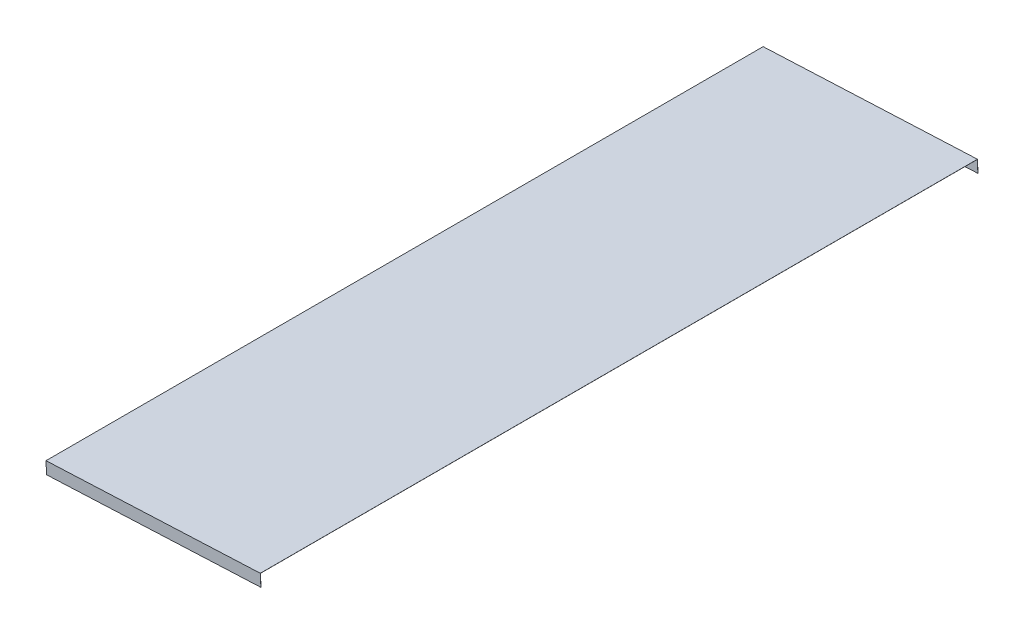
ISO-10303-21;
HEADER;
FILE_DESCRIPTION(('STEP AP214'),'2;1');
FILE_NAME('part.step','',(''),(''),'','','');
FILE_SCHEMA(('AUTOMOTIVE_DESIGN { 1 0 10303 214 1 1 1 1 }'));
ENDSEC;
DATA;
#1=APPLICATION_CONTEXT('core data for automotive mechanical design processes');
#2=APPLICATION_PROTOCOL_DEFINITION('international standard','automotive_design',2000,#1);
#3=PRODUCT_CONTEXT('',#1,'mechanical');
#4=PRODUCT('Part','Part','',(#3));
#5=PRODUCT_RELATED_PRODUCT_CATEGORY('part','',(#4));
#6=PRODUCT_DEFINITION_FORMATION('','',#4);
#7=PRODUCT_DEFINITION_CONTEXT('part definition',#1,'design');
#8=PRODUCT_DEFINITION('design','',#6,#7);
#9=PRODUCT_DEFINITION_SHAPE('','',#8);
#10=(LENGTH_UNIT() NAMED_UNIT(*) SI_UNIT(.MILLI.,.METRE.));
#11=(NAMED_UNIT(*) PLANE_ANGLE_UNIT() SI_UNIT($,.RADIAN.));
#12=(NAMED_UNIT(*) SI_UNIT($,.STERADIAN.) SOLID_ANGLE_UNIT());
#13=UNCERTAINTY_MEASURE_WITH_UNIT(LENGTH_MEASURE(1.E-05),#10,'distance_accuracy_value','');
#14=(GEOMETRIC_REPRESENTATION_CONTEXT(3) GLOBAL_UNCERTAINTY_ASSIGNED_CONTEXT((#13)) GLOBAL_UNIT_ASSIGNED_CONTEXT((#10,
#11,#12)) REPRESENTATION_CONTEXT('',''));
#15=CARTESIAN_POINT('',(0.,0.,0.));
#16=DIRECTION('',(0.,0.,1.));
#17=DIRECTION('',(1.,0.,0.));
#18=AXIS2_PLACEMENT_3D('',#15,#16,#17);
#19=CARTESIAN_POINT('',(-1723.97557604015,565.354199265099,600.));
#20=DIRECTION('',(0.998984631984017,0.0450522481099321,0.));
#21=DIRECTION('',(-0.0450522481099321,0.998984631984017,0.));
#22=AXIS2_PLACEMENT_3D('',#19,#20,#21);
#23=PLANE('',#22);
#24=DIRECTION('',(0.,0.,-1.));
#25=VECTOR('',#24,1.);
#26=CARTESIAN_POINT('',(-1723.97107081534,565.254300801901,600.));
#27=LINE('',#26,#25);
#28=CARTESIAN_POINT('',(-1723.97107081534,565.254300801901,599.9));
#29=VERTEX_POINT('',#28);
#30=CARTESIAN_POINT('',(-1723.97107081534,565.254300801901,0.099999999999989));
#31=VERTEX_POINT('',#30);
#32=EDGE_CURVE('E11',#29,#31,#27,.T.);
#33=ORIENTED_EDGE('',*,*,#32,.F.);
#34=DIRECTION('',(-0.0450522481090856,0.998984631984055,0.));
#35=VECTOR('',#34,1.);
#36=CARTESIAN_POINT('',(-1723.52505355906,555.364352945259,599.9));
#37=LINE('',#36,#35);
#38=CARTESIAN_POINT('',(-1723.52505355906,555.364352945259,599.9));
#39=VERTEX_POINT('',#38);
#40=EDGE_CURVE('E126',#39,#29,#37,.T.);
#41=ORIENTED_EDGE('',*,*,#40,.F.);
#42=DIRECTION('',(0.,0.,1.));
#43=VECTOR('',#42,1.);
#44=CARTESIAN_POINT('',(-1723.52505355906,555.364352945259,600.));
#45=LINE('',#44,#43);
#46=CARTESIAN_POINT('',(-1723.52505355906,555.364352945259,600.));
#47=VERTEX_POINT('',#46);
#48=EDGE_CURVE('E124',#39,#47,#45,.T.);
#49=ORIENTED_EDGE('',*,*,#48,.T.);
#50=DIRECTION('',(0.0450522481099321,-0.998984631984017,0.));
#51=VECTOR('',#50,1.);
#52=CARTESIAN_POINT('',(-1723.97557604015,565.354199265099,600.));
#53=LINE('',#52,#51);
#54=CARTESIAN_POINT('',(-1723.97557604015,565.354199265099,600.));
#55=VERTEX_POINT('',#54);
#56=EDGE_CURVE('E107',#55,#47,#53,.T.);
#57=ORIENTED_EDGE('',*,*,#56,.F.);
#58=DIRECTION('',(0.,0.,-1.));
#59=VECTOR('',#58,1.);
#60=CARTESIAN_POINT('',(-1723.97557604015,565.354199265099,600.));
#61=LINE('',#60,#59);
#62=CARTESIAN_POINT('',(-1723.97557604015,565.354199265099,0.));
#63=VERTEX_POINT('',#62);
#64=EDGE_CURVE('E155',#55,#63,#61,.T.);
#65=ORIENTED_EDGE('',*,*,#64,.T.);
#66=DIRECTION('',(0.0450522481099321,-0.998984631984017,0.));
#67=VECTOR('',#66,1.);
#68=CARTESIAN_POINT('',(-1723.97557604015,565.354199265099,0.));
#69=LINE('',#68,#67);
#70=CARTESIAN_POINT('',(-1723.52505355906,555.364352945259,0.));
#71=VERTEX_POINT('',#70);
#72=EDGE_CURVE('E151',#63,#71,#69,.T.);
#73=ORIENTED_EDGE('',*,*,#72,.T.);
#74=DIRECTION('',(0.,0.,1.));
#75=VECTOR('',#74,1.);
#76=CARTESIAN_POINT('',(-1723.52505355906,555.364352945259,0.));
#77=LINE('',#76,#75);
#78=CARTESIAN_POINT('',(-1723.52505355906,555.364352945259,0.099999999999989));
#79=VERTEX_POINT('',#78);
#80=EDGE_CURVE('E134',#71,#79,#77,.T.);
#81=ORIENTED_EDGE('',*,*,#80,.T.);
#82=DIRECTION('',(-0.0450522481090856,0.998984631984055,0.));
#83=VECTOR('',#82,1.);
#84=CARTESIAN_POINT('',(-1723.52505355906,555.364352945259,0.099999999999989));
#85=LINE('',#84,#83);
#86=EDGE_CURVE('E143',#79,#31,#85,.T.);
#87=ORIENTED_EDGE('',*,*,#86,.T.);
#88=EDGE_LOOP('',(#33,#41,#49,#57,#65,#73,#81,#87));
#89=FACE_BOUND('',#88,.T.);
#90=ADVANCED_FACE('F35',(#89),#23,.F.);
#91=CARTESIAN_POINT('',(-1723.97107081534,565.254300801901,600.));
#92=DIRECTION('',(-0.0450522481090856,0.998984631984055,0.));
#93=DIRECTION('',(-0.998984631984055,-0.0450522481090856,0.));
#94=AXIS2_PLACEMENT_3D('',#91,#92,#93);
#95=PLANE('',#94);
#96=DIRECTION('',(0.,0.,-1.));
#97=VECTOR('',#96,1.);
#98=CARTESIAN_POINT('',(-1544.64545143454,573.341534617114,600.));
#99=LINE('',#98,#97);
#100=CARTESIAN_POINT('',(-1544.64545143454,573.341534617114,599.9));
#101=VERTEX_POINT('',#100);
#102=CARTESIAN_POINT('',(-1544.64545143454,573.341534617114,0.099999999999989));
#103=VERTEX_POINT('',#102);
#104=EDGE_CURVE('E42',#101,#103,#99,.T.);
#105=ORIENTED_EDGE('',*,*,#104,.F.);
#106=DIRECTION('',(-0.998984631984055,-0.0450522481090856,0.));
#107=VECTOR('',#106,1.);
#108=CARTESIAN_POINT('',(-1723.97107081534,565.254300801901,599.9));
#109=LINE('',#108,#107);
#110=EDGE_CURVE('E128',#101,#29,#109,.T.);
#111=ORIENTED_EDGE('',*,*,#110,.T.);
#112=ORIENTED_EDGE('',*,*,#32,.T.);
#113=DIRECTION('',(0.998984631984055,0.0450522481090856,0.));
#114=VECTOR('',#113,1.);
#115=CARTESIAN_POINT('',(-1723.97107081534,565.254300801901,0.099999999999989));
#116=LINE('',#115,#114);
#117=EDGE_CURVE('E147',#31,#103,#116,.T.);
#118=ORIENTED_EDGE('',*,*,#117,.T.);
#119=EDGE_LOOP('',(#105,#111,#112,#118));
#120=FACE_BOUND('',#119,.T.);
#121=ADVANCED_FACE('F163',(#120),#95,.F.);
#122=CARTESIAN_POINT('',(-1544.64995665935,573.441433080312,600.));
#123=DIRECTION('',(-0.998984631984017,-0.0450522481099321,0.));
#124=DIRECTION('',(0.0450522481099321,-0.998984631984017,0.));
#125=AXIS2_PLACEMENT_3D('',#122,#123,#124);
#126=PLANE('',#125);
#127=DIRECTION('',(-0.0450522481099321,0.998984631984017,0.));
#128=VECTOR('',#127,1.);
#129=CARTESIAN_POINT('',(-1544.64995665935,573.441433080312,0.));
#130=LINE('',#129,#128);
#131=CARTESIAN_POINT('',(-1544.19943417826,563.451586760472,0.));
#132=VERTEX_POINT('',#131);
#133=CARTESIAN_POINT('',(-1544.64995665935,573.441433080312,0.));
#134=VERTEX_POINT('',#133);
#135=EDGE_CURVE('E157',#132,#134,#130,.T.);
#136=ORIENTED_EDGE('',*,*,#135,.T.);
#137=DIRECTION('',(0.,0.,-1.));
#138=VECTOR('',#137,1.);
#139=CARTESIAN_POINT('',(-1544.64995665935,573.441433080312,600.));
#140=LINE('',#139,#138);
#141=CARTESIAN_POINT('',(-1544.64995665935,573.441433080312,600.));
#142=VERTEX_POINT('',#141);
#143=EDGE_CURVE('E102',#142,#134,#140,.T.);
#144=ORIENTED_EDGE('',*,*,#143,.F.);
#145=DIRECTION('',(-0.0450522481099321,0.998984631984017,0.));
#146=VECTOR('',#145,1.);
#147=CARTESIAN_POINT('',(-1544.64995665935,573.441433080312,600.));
#148=LINE('',#147,#146);
#149=CARTESIAN_POINT('',(-1544.19943417826,563.451586760472,600.));
#150=VERTEX_POINT('',#149);
#151=EDGE_CURVE('E97',#150,#142,#148,.T.);
#152=ORIENTED_EDGE('',*,*,#151,.F.);
#153=DIRECTION('',(0.,0.,-1.));
#154=VECTOR('',#153,1.);
#155=CARTESIAN_POINT('',(-1544.19943417826,563.451586760472,599.9));
#156=LINE('',#155,#154);
#157=CARTESIAN_POINT('',(-1544.19943417826,563.451586760472,599.9));
#158=VERTEX_POINT('',#157);
#159=EDGE_CURVE('E101',#150,#158,#156,.T.);
#160=ORIENTED_EDGE('',*,*,#159,.T.);
#161=DIRECTION('',(-0.0450522481090856,0.998984631984055,0.));
#162=VECTOR('',#161,1.);
#163=CARTESIAN_POINT('',(-1544.19943417826,563.451586760472,599.9));
#164=LINE('',#163,#162);
#165=EDGE_CURVE('E49',#158,#101,#164,.T.);
#166=ORIENTED_EDGE('',*,*,#165,.T.);
#167=ORIENTED_EDGE('',*,*,#104,.T.);
#168=DIRECTION('',(-0.0450522481090856,0.998984631984055,0.));
#169=VECTOR('',#168,1.);
#170=CARTESIAN_POINT('',(-1544.19943417826,563.451586760472,0.099999999999989));
#171=LINE('',#170,#169);
#172=CARTESIAN_POINT('',(-1544.19943417826,563.451586760472,0.099999999999989));
#173=VERTEX_POINT('',#172);
#174=EDGE_CURVE('E144',#173,#103,#171,.T.);
#175=ORIENTED_EDGE('',*,*,#174,.F.);
#176=DIRECTION('',(0.,0.,-1.));
#177=VECTOR('',#176,1.);
#178=CARTESIAN_POINT('',(-1544.19943417826,563.451586760472,0.099999999999989));
#179=LINE('',#178,#177);
#180=EDGE_CURVE('E140',#173,#132,#179,.T.);
#181=ORIENTED_EDGE('',*,*,#180,.T.);
#182=EDGE_LOOP('',(#136,#144,#152,#160,#166,#167,#175,#181));
#183=FACE_BOUND('',#182,.T.);
#184=ADVANCED_FACE('F100',(#183),#126,.F.);
#185=CARTESIAN_POINT('',(-1723.97557604015,565.354199265099,600.));
#186=DIRECTION('',(0.0450522481090856,-0.998984631984055,0.));
#187=DIRECTION('',(0.998984631984055,0.0450522481090856,0.));
#188=AXIS2_PLACEMENT_3D('',#185,#186,#187);
#189=PLANE('',#188);
#190=DIRECTION('',(-0.998984631984055,-0.0450522481090856,0.));
#191=VECTOR('',#190,1.);
#192=CARTESIAN_POINT('',(-1723.97557604015,565.354199265099,0.));
#193=LINE('',#192,#191);
#194=EDGE_CURVE('E152',#134,#63,#193,.T.);
#195=ORIENTED_EDGE('',*,*,#194,.T.);
#196=ORIENTED_EDGE('',*,*,#64,.F.);
#197=DIRECTION('',(-0.998984631984055,-0.0450522481090856,0.));
#198=VECTOR('',#197,1.);
#199=CARTESIAN_POINT('',(-1723.97557604015,565.354199265099,600.));
#200=LINE('',#199,#198);
#201=EDGE_CURVE('E106',#142,#55,#200,.T.);
#202=ORIENTED_EDGE('',*,*,#201,.F.);
#203=ORIENTED_EDGE('',*,*,#143,.T.);
#204=EDGE_LOOP('',(#195,#196,#202,#203));
#205=FACE_BOUND('',#204,.T.);
#206=ADVANCED_FACE('F178',(#205),#189,.F.);
#207=CARTESIAN_POINT('',(0.,0.,600.));
#208=DIRECTION('',(0.,0.,1.));
#209=DIRECTION('',(1.,0.,0.));
#210=AXIS2_PLACEMENT_3D('',#207,#208,#209);
#211=PLANE('',#210);
#212=ORIENTED_EDGE('',*,*,#56,.T.);
#213=DIRECTION('',(0.998984631984055,0.0450522481090857,0.));
#214=VECTOR('',#213,1.);
#215=CARTESIAN_POINT('',(-1544.19943417826,563.451586760472,600.));
#216=LINE('',#215,#214);
#217=EDGE_CURVE('E114',#47,#150,#216,.T.);
#218=ORIENTED_EDGE('',*,*,#217,.T.);
#219=ORIENTED_EDGE('',*,*,#151,.T.);
#220=ORIENTED_EDGE('',*,*,#201,.T.);
#221=EDGE_LOOP('',(#212,#218,#219,#220));
#222=FACE_BOUND('',#221,.T.);
#223=ADVANCED_FACE('F119',(#222),#211,.T.);
#224=CARTESIAN_POINT('',(0.,0.,0.));
#225=DIRECTION('',(0.,0.,1.));
#226=DIRECTION('',(1.,0.,0.));
#227=AXIS2_PLACEMENT_3D('',#224,#225,#226);
#228=PLANE('',#227);
#229=ORIENTED_EDGE('',*,*,#72,.F.);
#230=ORIENTED_EDGE('',*,*,#194,.F.);
#231=ORIENTED_EDGE('',*,*,#135,.F.);
#232=DIRECTION('',(-0.998984631984055,-0.0450522481090857,0.));
#233=VECTOR('',#232,1.);
#234=CARTESIAN_POINT('',(-1544.19943417826,563.451586760472,0.));
#235=LINE('',#234,#233);
#236=EDGE_CURVE('E131',#132,#71,#235,.T.);
#237=ORIENTED_EDGE('',*,*,#236,.T.);
#238=EDGE_LOOP('',(#229,#230,#231,#237));
#239=FACE_BOUND('',#238,.T.);
#240=ADVANCED_FACE('F175',(#239),#228,.F.);
#241=CARTESIAN_POINT('',(-1723.52505355906,555.364352945259,0.099999999999989));
#242=DIRECTION('',(0.,0.,1.));
#243=DIRECTION('',(1.,0.,0.));
#244=AXIS2_PLACEMENT_3D('',#241,#242,#243);
#245=PLANE('',#244);
#246=ORIENTED_EDGE('',*,*,#117,.F.);
#247=ORIENTED_EDGE('',*,*,#86,.F.);
#248=DIRECTION('',(0.998984631984055,0.0450522481090857,0.));
#249=VECTOR('',#248,1.);
#250=CARTESIAN_POINT('',(-1723.52505355906,555.364352945259,0.099999999999989));
#251=LINE('',#250,#249);
#252=EDGE_CURVE('E137',#79,#173,#251,.T.);
#253=ORIENTED_EDGE('',*,*,#252,.T.);
#254=ORIENTED_EDGE('',*,*,#174,.T.);
#255=EDGE_LOOP('',(#246,#247,#253,#254));
#256=FACE_BOUND('',#255,.T.);
#257=ADVANCED_FACE('F165',(#256),#245,.T.);
#258=CARTESIAN_POINT('',(-28.4932552148103,631.806963458825,0.));
#259=DIRECTION('',(-0.0450522481090857,0.998984631984055,0.));
#260=DIRECTION('',(-0.998984631984055,-0.0450522481090857,0.));
#261=AXIS2_PLACEMENT_3D('',#258,#259,#260);
#262=PLANE('',#261);
#263=ORIENTED_EDGE('',*,*,#236,.F.);
#264=ORIENTED_EDGE('',*,*,#180,.F.);
#265=ORIENTED_EDGE('',*,*,#252,.F.);
#266=ORIENTED_EDGE('',*,*,#80,.F.);
#267=EDGE_LOOP('',(#263,#264,#265,#266));
#268=FACE_BOUND('',#267,.T.);
#269=ADVANCED_FACE('F171',(#268),#262,.F.);
#270=CARTESIAN_POINT('',(-1723.52505355906,555.364352945259,599.9));
#271=DIRECTION('',(0.,0.,-1.));
#272=DIRECTION('',(-1.,0.,0.));
#273=AXIS2_PLACEMENT_3D('',#270,#271,#272);
#274=PLANE('',#273);
#275=ORIENTED_EDGE('',*,*,#110,.F.);
#276=ORIENTED_EDGE('',*,*,#165,.F.);
#277=DIRECTION('',(-0.998984631984055,-0.0450522481090857,0.));
#278=VECTOR('',#277,1.);
#279=CARTESIAN_POINT('',(-1723.52505355906,555.364352945259,599.9));
#280=LINE('',#279,#278);
#281=EDGE_CURVE('E117',#158,#39,#280,.T.);
#282=ORIENTED_EDGE('',*,*,#281,.T.);
#283=ORIENTED_EDGE('',*,*,#40,.T.);
#284=EDGE_LOOP('',(#275,#276,#282,#283));
#285=FACE_BOUND('',#284,.T.);
#286=ADVANCED_FACE('F181',(#285),#274,.T.);
#287=CARTESIAN_POINT('',(-28.4932552148103,631.806963458825,0.));
#288=DIRECTION('',(0.0450522481090857,-0.998984631984055,0.));
#289=DIRECTION('',(0.998984631984055,0.0450522481090857,0.));
#290=AXIS2_PLACEMENT_3D('',#287,#288,#289);
#291=PLANE('',#290);
#292=ORIENTED_EDGE('',*,*,#217,.F.);
#293=ORIENTED_EDGE('',*,*,#48,.F.);
#294=ORIENTED_EDGE('',*,*,#281,.F.);
#295=ORIENTED_EDGE('',*,*,#159,.F.);
#296=EDGE_LOOP('',(#292,#293,#294,#295));
#297=FACE_BOUND('',#296,.T.);
#298=ADVANCED_FACE('F112',(#297),#291,.T.);
#299=CLOSED_SHELL('',(#90,#121,#184,#206,#223,#240,#257,#269,#286,#298));
#300=MANIFOLD_SOLID_BREP('B2',#299);
#301=ADVANCED_BREP_SHAPE_REPRESENTATION('',(#18,#300),#14);
#302=SHAPE_DEFINITION_REPRESENTATION(#9,#301);
ENDSEC;
END-ISO-10303-21;
